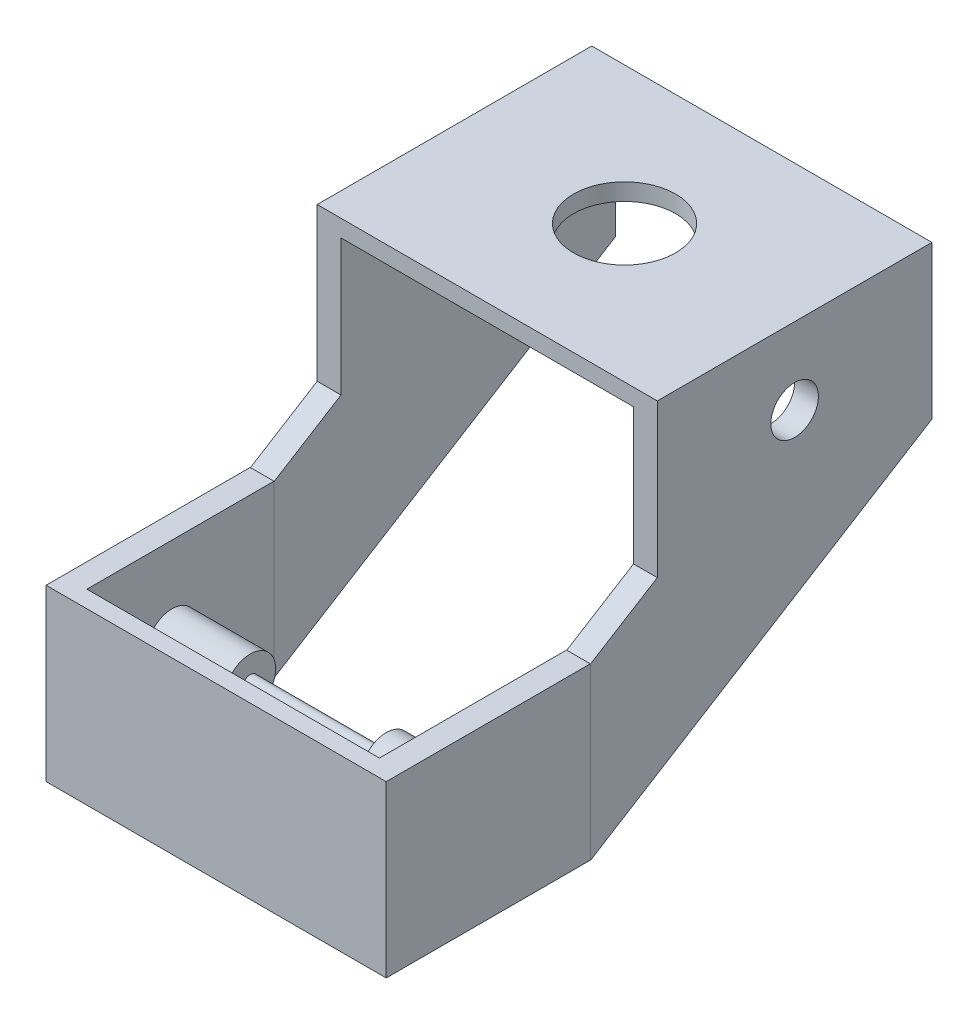
ISO-10303-21;
HEADER;
FILE_DESCRIPTION(('STEP AP214'),'2;1');
FILE_NAME('part.step','',(''),(''),'','','');
FILE_SCHEMA(('AUTOMOTIVE_DESIGN { 1 0 10303 214 1 1 1 1 }'));
ENDSEC;
DATA;
#1=APPLICATION_CONTEXT('core data for automotive mechanical design processes');
#2=APPLICATION_PROTOCOL_DEFINITION('international standard','automotive_design',2000,#1);
#3=PRODUCT_CONTEXT('',#1,'mechanical');
#4=PRODUCT('Part','Part','',(#3));
#5=PRODUCT_RELATED_PRODUCT_CATEGORY('part','',(#4));
#6=PRODUCT_DEFINITION_FORMATION('','',#4);
#7=PRODUCT_DEFINITION_CONTEXT('part definition',#1,'design');
#8=PRODUCT_DEFINITION('design','',#6,#7);
#9=PRODUCT_DEFINITION_SHAPE('','',#8);
#10=(LENGTH_UNIT() NAMED_UNIT(*) SI_UNIT(.MILLI.,.METRE.));
#11=(NAMED_UNIT(*) PLANE_ANGLE_UNIT() SI_UNIT($,.RADIAN.));
#12=(NAMED_UNIT(*) SI_UNIT($,.STERADIAN.) SOLID_ANGLE_UNIT());
#13=UNCERTAINTY_MEASURE_WITH_UNIT(LENGTH_MEASURE(1.E-05),#10,'distance_accuracy_value','');
#14=(GEOMETRIC_REPRESENTATION_CONTEXT(3) GLOBAL_UNCERTAINTY_ASSIGNED_CONTEXT((#13)) GLOBAL_UNIT_ASSIGNED_CONTEXT((#10,
#11,#12)) REPRESENTATION_CONTEXT('',''));
#15=CARTESIAN_POINT('',(0.,0.,0.));
#16=DIRECTION('',(0.,0.,1.));
#17=DIRECTION('',(1.,0.,0.));
#18=AXIS2_PLACEMENT_3D('',#15,#16,#17);
#19=CARTESIAN_POINT('',(0.,0.,-55.));
#20=DIRECTION('',(0.,0.,-1.));
#21=DIRECTION('',(-1.,0.,0.));
#22=AXIS2_PLACEMENT_3D('',#19,#20,#21);
#23=PLANE('',#22);
#24=DIRECTION('',(-1.,0.,0.));
#25=VECTOR('',#24,1.);
#26=CARTESIAN_POINT('',(51.4285714285715,40.5357142857143,-55.));
#27=LINE('',#26,#25);
#28=CARTESIAN_POINT('',(44.5,40.5357142857143,-55.));
#29=VERTEX_POINT('',#28);
#30=CARTESIAN_POINT('',(44.4285714285715,40.5357142857143,-55.));
#31=VERTEX_POINT('',#30);
#32=EDGE_CURVE('E303',#29,#31,#27,.T.);
#33=ORIENTED_EDGE('',*,*,#32,.F.);
#34=DIRECTION('',(0.,-1.,0.));
#35=VECTOR('',#34,1.);
#36=CARTESIAN_POINT('',(44.5,40.5357142857143,-55.));
#37=LINE('',#36,#35);
#38=CARTESIAN_POINT('',(44.5,-9.46428571428572,-55.));
#39=VERTEX_POINT('',#38);
#40=EDGE_CURVE('E254',#29,#39,#37,.T.);
#41=ORIENTED_EDGE('',*,*,#40,.T.);
#42=DIRECTION('',(1.,0.,0.));
#43=VECTOR('',#42,1.);
#44=CARTESIAN_POINT('',(51.4285714285715,-9.46428571428572,-55.));
#45=LINE('',#44,#43);
#46=CARTESIAN_POINT('',(44.4285714285715,-9.46428571428572,-55.));
#47=VERTEX_POINT('',#46);
#48=EDGE_CURVE('E311',#47,#39,#45,.T.);
#49=ORIENTED_EDGE('',*,*,#48,.F.);
#50=DIRECTION('',(0.,-1.,0.));
#51=VECTOR('',#50,1.);
#52=CARTESIAN_POINT('',(44.4285714285715,40.5357142857143,-55.));
#53=LINE('',#52,#51);
#54=EDGE_CURVE('E307',#31,#47,#53,.T.);
#55=ORIENTED_EDGE('',*,*,#54,.F.);
#56=EDGE_LOOP('',(#33,#41,#49,#55));
#57=FACE_BOUND('',#56,.T.);
#58=ADVANCED_FACE('F33',(#57),#23,.T.);
#59=CARTESIAN_POINT('',(-48.5714285714285,40.5357142857143,5.));
#60=DIRECTION('',(1.,0.,0.));
#61=DIRECTION('',(0.,1.,0.));
#62=AXIS2_PLACEMENT_3D('',#59,#60,#61);
#63=PLANE('',#62);
#64=DIRECTION('',(0.,0.,-1.));
#65=VECTOR('',#64,1.);
#66=CARTESIAN_POINT('',(-48.5714285714285,40.5357142857143,5.));
#67=LINE('',#66,#65);
#68=CARTESIAN_POINT('',(-48.5714285714285,40.5357142857143,5.));
#69=VERTEX_POINT('',#68);
#70=CARTESIAN_POINT('',(-48.5714285714285,40.5357142857143,-55.));
#71=VERTEX_POINT('',#70);
#72=EDGE_CURVE('E332',#69,#71,#67,.T.);
#73=ORIENTED_EDGE('',*,*,#72,.T.);
#74=DIRECTION('',(0.,-1.,0.));
#75=VECTOR('',#74,1.);
#76=CARTESIAN_POINT('',(-48.5714285714285,40.5357142857143,-55.));
#77=LINE('',#76,#75);
#78=CARTESIAN_POINT('',(-48.5714285714285,-9.46428571428572,-55.));
#79=VERTEX_POINT('',#78);
#80=EDGE_CURVE('E279',#71,#79,#77,.T.);
#81=ORIENTED_EDGE('',*,*,#80,.T.);
#82=DIRECTION('',(0.,0.,-1.));
#83=VECTOR('',#82,1.);
#84=CARTESIAN_POINT('',(-48.5714285714285,-9.46428571428572,5.));
#85=LINE('',#84,#83);
#86=CARTESIAN_POINT('',(-48.5714285714285,-9.46428571428572,5.));
#87=VERTEX_POINT('',#86);
#88=EDGE_CURVE('E344',#87,#79,#85,.T.);
#89=ORIENTED_EDGE('',*,*,#88,.F.);
#90=DIRECTION('',(0.,-1.,0.));
#91=VECTOR('',#90,1.);
#92=CARTESIAN_POINT('',(-48.5714285714285,40.5357142857143,5.));
#93=LINE('',#92,#91);
#94=EDGE_CURVE('E322',#69,#87,#93,.T.);
#95=ORIENTED_EDGE('',*,*,#94,.F.);
#96=EDGE_LOOP('',(#73,#81,#89,#95));
#97=FACE_BOUND('',#96,.T.);
#98=ADVANCED_FACE('F35',(#97),#63,.F.);
#99=CARTESIAN_POINT('',(-48.5714285714285,-9.46428571428572,5.));
#100=DIRECTION('',(0.,1.,0.));
#101=DIRECTION('',(0.,0.,1.));
#102=AXIS2_PLACEMENT_3D('',#99,#100,#101);
#103=PLANE('',#102);
#104=ORIENTED_EDGE('',*,*,#88,.T.);
#105=DIRECTION('',(1.,0.,0.));
#106=VECTOR('',#105,1.);
#107=CARTESIAN_POINT('',(-48.5714285714285,-9.46428571428572,-55.));
#108=LINE('',#107,#106);
#109=CARTESIAN_POINT('',(-48.4999999999996,-9.46428571428572,-55.));
#110=VERTEX_POINT('',#109);
#111=EDGE_CURVE('E282',#79,#110,#108,.T.);
#112=ORIENTED_EDGE('',*,*,#111,.T.);
#113=DIRECTION('',(1.,0.,0.));
#114=VECTOR('',#113,1.);
#115=CARTESIAN_POINT('',(-48.4999999999996,-9.46428571428572,-55.0000000000007));
#116=LINE('',#115,#114);
#117=CARTESIAN_POINT('',(-41.5714285714285,-9.46428571428572,-55.0000000000006));
#118=VERTEX_POINT('',#117);
#119=EDGE_CURVE('E48',#110,#118,#116,.T.);
#120=ORIENTED_EDGE('',*,*,#119,.T.);
#121=DIRECTION('',(0.,0.,1.));
#122=VECTOR('',#121,1.);
#123=CARTESIAN_POINT('',(-41.5714285714285,-9.46428571428572,-55.));
#124=LINE('',#123,#122);
#125=CARTESIAN_POINT('',(-41.5714285714285,-9.46428571428572,0.));
#126=VERTEX_POINT('',#125);
#127=EDGE_CURVE('E292',#118,#126,#124,.T.);
#128=ORIENTED_EDGE('',*,*,#127,.T.);
#129=DIRECTION('',(1.,0.,0.));
#130=VECTOR('',#129,1.);
#131=CARTESIAN_POINT('',(-48.5714285714285,-9.46428571428572,0.));
#132=LINE('',#131,#130);
#133=CARTESIAN_POINT('',(44.4285714285715,-9.46428571428572,0.));
#134=VERTEX_POINT('',#133);
#135=EDGE_CURVE('E320',#126,#134,#132,.T.);
#136=ORIENTED_EDGE('',*,*,#135,.T.);
#137=DIRECTION('',(0.,0.,1.));
#138=VECTOR('',#137,1.);
#139=CARTESIAN_POINT('',(44.4285714285715,-9.46428571428572,-55.));
#140=LINE('',#139,#138);
#141=EDGE_CURVE('E317',#47,#134,#140,.T.);
#142=ORIENTED_EDGE('',*,*,#141,.F.);
#143=ORIENTED_EDGE('',*,*,#48,.T.);
#144=CARTESIAN_POINT('',(51.4285714285715,-9.46428571428572,-55.));
#145=VERTEX_POINT('',#144);
#146=EDGE_CURVE('E310',#39,#145,#45,.T.);
#147=ORIENTED_EDGE('',*,*,#146,.T.);
#148=DIRECTION('',(0.,0.,-1.));
#149=VECTOR('',#148,1.);
#150=CARTESIAN_POINT('',(51.4285714285715,-9.46428571428572,5.));
#151=LINE('',#150,#149);
#152=CARTESIAN_POINT('',(51.4285714285715,-9.46428571428572,5.));
#153=VERTEX_POINT('',#152);
#154=EDGE_CURVE('E341',#153,#145,#151,.T.);
#155=ORIENTED_EDGE('',*,*,#154,.F.);
#156=DIRECTION('',(1.,0.,0.));
#157=VECTOR('',#156,1.);
#158=CARTESIAN_POINT('',(-48.5714285714285,-9.46428571428572,5.));
#159=LINE('',#158,#157);
#160=EDGE_CURVE('E325',#87,#153,#159,.T.);
#161=ORIENTED_EDGE('',*,*,#160,.F.);
#162=EDGE_LOOP('',(#104,#112,#120,#128,#136,#142,#143,#147,#155,#161));
#163=FACE_BOUND('',#162,.T.);
#164=ADVANCED_FACE('F377',(#163),#103,.F.);
#165=CARTESIAN_POINT('',(51.4285714285715,40.5357142857143,5.));
#166=DIRECTION('',(-1.,0.,0.));
#167=DIRECTION('',(0.,-1.,0.));
#168=AXIS2_PLACEMENT_3D('',#165,#166,#167);
#169=PLANE('',#168);
#170=ORIENTED_EDGE('',*,*,#154,.T.);
#171=DIRECTION('',(0.,1.,0.));
#172=VECTOR('',#171,1.);
#173=CARTESIAN_POINT('',(51.4285714285715,40.5357142857143,-55.));
#174=LINE('',#173,#172);
#175=CARTESIAN_POINT('',(51.4285714285715,40.5357142857143,-55.));
#176=VERTEX_POINT('',#175);
#177=EDGE_CURVE('E300',#145,#176,#174,.T.);
#178=ORIENTED_EDGE('',*,*,#177,.T.);
#179=DIRECTION('',(0.,0.,-1.));
#180=VECTOR('',#179,1.);
#181=CARTESIAN_POINT('',(51.4285714285715,40.5357142857143,5.));
#182=LINE('',#181,#180);
#183=CARTESIAN_POINT('',(51.4285714285715,40.5357142857143,5.));
#184=VERTEX_POINT('',#183);
#185=EDGE_CURVE('E338',#184,#176,#182,.T.);
#186=ORIENTED_EDGE('',*,*,#185,.F.);
#187=DIRECTION('',(0.,1.,0.));
#188=VECTOR('',#187,1.);
#189=CARTESIAN_POINT('',(51.4285714285715,40.5357142857143,5.));
#190=LINE('',#189,#188);
#191=EDGE_CURVE('E328',#153,#184,#190,.T.);
#192=ORIENTED_EDGE('',*,*,#191,.F.);
#193=EDGE_LOOP('',(#170,#178,#186,#192));
#194=FACE_BOUND('',#193,.T.);
#195=ADVANCED_FACE('F399',(#194),#169,.F.);
#196=CARTESIAN_POINT('',(-48.5714285714285,40.5357142857143,5.));
#197=DIRECTION('',(0.,-1.,0.));
#198=DIRECTION('',(0.,0.,-1.));
#199=AXIS2_PLACEMENT_3D('',#196,#197,#198);
#200=PLANE('',#199);
#201=ORIENTED_EDGE('',*,*,#185,.T.);
#202=EDGE_CURVE('E304',#176,#29,#27,.T.);
#203=ORIENTED_EDGE('',*,*,#202,.T.);
#204=ORIENTED_EDGE('',*,*,#32,.T.);
#205=DIRECTION('',(0.,0.,1.));
#206=VECTOR('',#205,1.);
#207=CARTESIAN_POINT('',(44.4285714285715,40.5357142857143,-55.));
#208=LINE('',#207,#206);
#209=CARTESIAN_POINT('',(44.4285714285715,40.5357142857143,0.));
#210=VERTEX_POINT('',#209);
#211=EDGE_CURVE('E314',#31,#210,#208,.T.);
#212=ORIENTED_EDGE('',*,*,#211,.T.);
#213=DIRECTION('',(-1.,0.,0.));
#214=VECTOR('',#213,1.);
#215=CARTESIAN_POINT('',(-48.5714285714285,40.5357142857143,0.));
#216=LINE('',#215,#214);
#217=CARTESIAN_POINT('',(-41.5714285714285,40.5357142857143,0.));
#218=VERTEX_POINT('',#217);
#219=EDGE_CURVE('E326',#210,#218,#216,.T.);
#220=ORIENTED_EDGE('',*,*,#219,.T.);
#221=DIRECTION('',(0.,0.,1.));
#222=VECTOR('',#221,1.);
#223=CARTESIAN_POINT('',(-41.5714285714285,40.5357142857143,-55.));
#224=LINE('',#223,#222);
#225=CARTESIAN_POINT('',(-41.5714285714285,40.5357142857143,-55.0000000000006));
#226=VERTEX_POINT('',#225);
#227=EDGE_CURVE('E295',#226,#218,#224,.T.);
#228=ORIENTED_EDGE('',*,*,#227,.F.);
#229=DIRECTION('',(-1.,0.,0.));
#230=VECTOR('',#229,1.);
#231=CARTESIAN_POINT('',(-48.5714285714285,40.5357142857143,-55.));
#232=LINE('',#231,#230);
#233=CARTESIAN_POINT('',(-48.4999999999996,40.5357142857143,-55.0000000000007));
#234=VERTEX_POINT('',#233);
#235=EDGE_CURVE('E289',#226,#234,#232,.T.);
#236=ORIENTED_EDGE('',*,*,#235,.T.);
#237=EDGE_CURVE('E288',#234,#71,#232,.T.);
#238=ORIENTED_EDGE('',*,*,#237,.T.);
#239=ORIENTED_EDGE('',*,*,#72,.F.);
#240=DIRECTION('',(-1.,0.,0.));
#241=VECTOR('',#240,1.);
#242=CARTESIAN_POINT('',(-48.5714285714285,40.5357142857143,5.));
#243=LINE('',#242,#241);
#244=EDGE_CURVE('E330',#184,#69,#243,.T.);
#245=ORIENTED_EDGE('',*,*,#244,.F.);
#246=EDGE_LOOP('',(#201,#203,#204,#212,#220,#228,#236,#238,#239,#245));
#247=FACE_BOUND('',#246,.T.);
#248=ADVANCED_FACE('F392',(#247),#200,.F.);
#249=CARTESIAN_POINT('',(0.,0.,5.));
#250=DIRECTION('',(0.,0.,1.));
#251=DIRECTION('',(1.,0.,0.));
#252=AXIS2_PLACEMENT_3D('',#249,#250,#251);
#253=PLANE('',#252);
#254=ORIENTED_EDGE('',*,*,#94,.T.);
#255=ORIENTED_EDGE('',*,*,#160,.T.);
#256=ORIENTED_EDGE('',*,*,#191,.T.);
#257=ORIENTED_EDGE('',*,*,#244,.T.);
#258=EDGE_LOOP('',(#254,#255,#256,#257));
#259=FACE_BOUND('',#258,.T.);
#260=ADVANCED_FACE('F389',(#259),#253,.T.);
#261=CARTESIAN_POINT('',(0.,0.,0.));
#262=DIRECTION('',(0.,0.,1.));
#263=DIRECTION('',(1.,0.,0.));
#264=AXIS2_PLACEMENT_3D('',#261,#262,#263);
#265=PLANE('',#264);
#266=ORIENTED_EDGE('',*,*,#135,.F.);
#267=DIRECTION('',(0.,1.,0.));
#268=VECTOR('',#267,1.);
#269=CARTESIAN_POINT('',(-41.5714285714285,40.5357142857143,0.));
#270=LINE('',#269,#268);
#271=EDGE_CURVE('E278',#126,#218,#270,.T.);
#272=ORIENTED_EDGE('',*,*,#271,.T.);
#273=ORIENTED_EDGE('',*,*,#219,.F.);
#274=DIRECTION('',(0.,-1.,0.));
#275=VECTOR('',#274,1.);
#276=CARTESIAN_POINT('',(44.4285714285715,40.5357142857143,0.));
#277=LINE('',#276,#275);
#278=EDGE_CURVE('E297',#210,#134,#277,.T.);
#279=ORIENTED_EDGE('',*,*,#278,.T.);
#280=EDGE_LOOP('',(#266,#272,#273,#279));
#281=FACE_BOUND('',#280,.T.);
#282=ADVANCED_FACE('F387',(#281),#265,.F.);
#283=CARTESIAN_POINT('',(44.4285714285715,40.5357142857143,-55.));
#284=DIRECTION('',(-1.,0.,0.));
#285=DIRECTION('',(0.,-1.,0.));
#286=AXIS2_PLACEMENT_3D('',#283,#284,#285);
#287=PLANE('',#286);
#288=CARTESIAN_POINT('',(44.4285714285715,15.5357142857143,-25.));
#289=DIRECTION('',(-1.,0.,0.));
#290=DIRECTION('',(0.,-1.,0.));
#291=AXIS2_PLACEMENT_3D('',#288,#289,#290);
#292=CIRCLE('',#291,7.5);
#293=CARTESIAN_POINT('',(44.4285714285715,8.0357142857143,-25.));
#294=VERTEX_POINT('',#293);
#295=EDGE_CURVE('E526',#294,#294,#292,.T.);
#296=ORIENTED_EDGE('',*,*,#295,.F.);
#297=EDGE_LOOP('',(#296));
#298=FACE_BOUND('',#297,.T.);
#299=ORIENTED_EDGE('',*,*,#278,.F.);
#300=ORIENTED_EDGE('',*,*,#211,.F.);
#301=ORIENTED_EDGE('',*,*,#54,.T.);
#302=ORIENTED_EDGE('',*,*,#141,.T.);
#303=EDGE_LOOP('',(#299,#300,#301,#302));
#304=FACE_BOUND('',#303,.T.);
#305=ADVANCED_FACE('F384',(#298,#304),#287,.T.);
#306=CARTESIAN_POINT('',(-41.5714285714285,40.5357142857143,-55.));
#307=DIRECTION('',(1.,0.,0.));
#308=DIRECTION('',(0.,1.,0.));
#309=AXIS2_PLACEMENT_3D('',#306,#307,#308);
#310=PLANE('',#309);
#311=CARTESIAN_POINT('',(-41.5714285714285,15.5357142857143,-25.));
#312=DIRECTION('',(1.,0.,0.));
#313=DIRECTION('',(0.,1.,0.));
#314=AXIS2_PLACEMENT_3D('',#311,#312,#313);
#315=CIRCLE('',#314,7.5);
#316=CARTESIAN_POINT('',(-41.5714285714285,23.0357142857143,-25.));
#317=VERTEX_POINT('',#316);
#318=EDGE_CURVE('E532',#317,#317,#315,.T.);
#319=ORIENTED_EDGE('',*,*,#318,.F.);
#320=EDGE_LOOP('',(#319));
#321=FACE_BOUND('',#320,.T.);
#322=ORIENTED_EDGE('',*,*,#271,.F.);
#323=ORIENTED_EDGE('',*,*,#127,.F.);
#324=DIRECTION('',(0.,1.,0.));
#325=VECTOR('',#324,1.);
#326=CARTESIAN_POINT('',(-41.5714285714285,40.5357142857143,-55.));
#327=LINE('',#326,#325);
#328=EDGE_CURVE('E285',#118,#226,#327,.T.);
#329=ORIENTED_EDGE('',*,*,#328,.T.);
#330=ORIENTED_EDGE('',*,*,#227,.T.);
#331=EDGE_LOOP('',(#322,#323,#329,#330));
#332=FACE_BOUND('',#331,.T.);
#333=ADVANCED_FACE('F382',(#321,#332),#310,.T.);
#334=CARTESIAN_POINT('',(0.,0.,-55.));
#335=DIRECTION('',(0.,0.,1.));
#336=DIRECTION('',(1.,0.,0.));
#337=AXIS2_PLACEMENT_3D('',#334,#335,#336);
#338=PLANE('',#337);
#339=ORIENTED_EDGE('',*,*,#237,.F.);
#340=DIRECTION('',(0.,1.,0.));
#341=VECTOR('',#340,1.);
#342=CARTESIAN_POINT('',(-48.4999999999996,-9.46428571428572,-55.0000000000007));
#343=LINE('',#342,#341);
#344=EDGE_CURVE('E236',#110,#234,#343,.T.);
#345=ORIENTED_EDGE('',*,*,#344,.F.);
#346=ORIENTED_EDGE('',*,*,#111,.F.);
#347=ORIENTED_EDGE('',*,*,#80,.F.);
#348=EDGE_LOOP('',(#339,#345,#346,#347));
#349=FACE_BOUND('',#348,.T.);
#350=ADVANCED_FACE('F415',(#349),#338,.F.);
#351=CARTESIAN_POINT('',(51.5,40.5357142857143,-55.));
#352=DIRECTION('',(0.,0.,-1.));
#353=DIRECTION('',(-1.,0.,0.));
#354=AXIS2_PLACEMENT_3D('',#351,#352,#353);
#355=PLANE('',#354);
#356=DIRECTION('',(-1.,0.,0.));
#357=VECTOR('',#356,1.);
#358=CARTESIAN_POINT('',(51.5,40.5357142857143,-55.));
#359=LINE('',#358,#357);
#360=CARTESIAN_POINT('',(51.5,40.5357142857143,-55.));
#361=VERTEX_POINT('',#360);
#362=EDGE_CURVE('E263',#361,#176,#359,.T.);
#363=ORIENTED_EDGE('',*,*,#362,.T.);
#364=ORIENTED_EDGE('',*,*,#177,.F.);
#365=DIRECTION('',(-1.,0.,0.));
#366=VECTOR('',#365,1.);
#367=CARTESIAN_POINT('',(51.5,-9.46428571428572,-55.));
#368=LINE('',#367,#366);
#369=CARTESIAN_POINT('',(51.5,-9.46428571428572,-55.));
#370=VERTEX_POINT('',#369);
#371=EDGE_CURVE('E275',#370,#145,#368,.T.);
#372=ORIENTED_EDGE('',*,*,#371,.F.);
#373=DIRECTION('',(0.,-1.,0.));
#374=VECTOR('',#373,1.);
#375=CARTESIAN_POINT('',(51.5,40.5357142857143,-55.));
#376=LINE('',#375,#374);
#377=EDGE_CURVE('E255',#361,#370,#376,.T.);
#378=ORIENTED_EDGE('',*,*,#377,.F.);
#379=EDGE_LOOP('',(#363,#364,#372,#378));
#380=FACE_BOUND('',#379,.T.);
#381=ADVANCED_FACE('F461',(#380),#355,.F.);
#382=CARTESIAN_POINT('',(51.5,-9.46428571428572,-55.));
#383=DIRECTION('',(0.,0.85013958156878,0.526557396539124));
#384=DIRECTION('',(0.,-0.526557396539124,0.85013958156878));
#385=AXIS2_PLACEMENT_3D('',#382,#383,#384);
#386=PLANE('',#385);
#387=DIRECTION('',(0.,0.526557396539124,-0.850139581568779));
#388=VECTOR('',#387,1.);
#389=CARTESIAN_POINT('',(44.5,-9.46428571428572,-55.));
#390=LINE('',#389,#388);
#391=CARTESIAN_POINT('',(44.5,52.6962567288137,-155.359690871303));
#392=VERTEX_POINT('',#391);
#393=EDGE_CURVE('E56',#39,#392,#390,.T.);
#394=ORIENTED_EDGE('',*,*,#393,.T.);
#395=DIRECTION('',(-1.,0.,0.));
#396=VECTOR('',#395,1.);
#397=CARTESIAN_POINT('',(51.5,52.6962567288137,-155.359690871303));
#398=LINE('',#397,#396);
#399=CARTESIAN_POINT('',(51.5,52.6962567288137,-155.359690871303));
#400=VERTEX_POINT('',#399);
#401=EDGE_CURVE('E272',#400,#392,#398,.T.);
#402=ORIENTED_EDGE('',*,*,#401,.F.);
#403=DIRECTION('',(0.,0.526557396539124,-0.850139581568779));
#404=VECTOR('',#403,1.);
#405=CARTESIAN_POINT('',(51.5,-9.46428571428572,-55.));
#406=LINE('',#405,#404);
#407=EDGE_CURVE('E258',#370,#400,#406,.T.);
#408=ORIENTED_EDGE('',*,*,#407,.F.);
#409=ORIENTED_EDGE('',*,*,#371,.T.);
#410=ORIENTED_EDGE('',*,*,#146,.F.);
#411=EDGE_LOOP('',(#394,#402,#408,#409,#410));
#412=FACE_BOUND('',#411,.T.);
#413=ADVANCED_FACE('F449',(#412),#386,.F.);
#414=CARTESIAN_POINT('',(51.5,40.5357142857143,-55.));
#415=DIRECTION('',(0.,-0.850139581568782,-0.526557396539121));
#416=DIRECTION('',(0.,0.526557396539121,-0.850139581568782));
#417=AXIS2_PLACEMENT_3D('',#414,#415,#416);
#418=PLANE('',#417);
#419=DIRECTION('',(0.,-0.526557396539121,0.850139581568782));
#420=VECTOR('',#419,1.);
#421=CARTESIAN_POINT('',(44.5,40.5357142857143,-55.));
#422=LINE('',#421,#420);
#423=CARTESIAN_POINT('',(44.5,52.6962567288137,-74.633488262011));
#424=VERTEX_POINT('',#423);
#425=EDGE_CURVE('E259',#424,#29,#422,.T.);
#426=ORIENTED_EDGE('',*,*,#425,.T.);
#427=ORIENTED_EDGE('',*,*,#202,.F.);
#428=ORIENTED_EDGE('',*,*,#362,.F.);
#429=DIRECTION('',(0.,-0.526557396539121,0.850139581568782));
#430=VECTOR('',#429,1.);
#431=CARTESIAN_POINT('',(51.5,40.5357142857143,-55.));
#432=LINE('',#431,#430);
#433=CARTESIAN_POINT('',(51.5,52.6962567288137,-74.633488262011));
#434=VERTEX_POINT('',#433);
#435=EDGE_CURVE('E261',#434,#361,#432,.T.);
#436=ORIENTED_EDGE('',*,*,#435,.F.);
#437=DIRECTION('',(-1.,0.,0.));
#438=VECTOR('',#437,1.);
#439=CARTESIAN_POINT('',(51.5,52.6962567288137,-74.633488262011));
#440=LINE('',#439,#438);
#441=EDGE_CURVE('E270',#434,#424,#440,.T.);
#442=ORIENTED_EDGE('',*,*,#441,.T.);
#443=EDGE_LOOP('',(#426,#427,#428,#436,#442));
#444=FACE_BOUND('',#443,.T.);
#445=ADVANCED_FACE('F436',(#444),#418,.F.);
#446=CARTESIAN_POINT('',(51.5,0.,0.));
#447=DIRECTION('',(1.,0.,0.));
#448=DIRECTION('',(0.,0.,-1.));
#449=AXIS2_PLACEMENT_3D('',#446,#447,#448);
#450=PLANE('',#449);
#451=CARTESIAN_POINT('',(51.5000000000008,75.1962567288137,-114.996589566657));
#452=DIRECTION('',(-1.,0.,0.));
#453=DIRECTION('',(0.,0.,1.));
#454=AXIS2_PLACEMENT_3D('',#451,#452,#453);
#455=CIRCLE('',#454,7.);
#456=CARTESIAN_POINT('',(51.5000000000008,75.1962567288137,-107.996589566657));
#457=VERTEX_POINT('',#456);
#458=EDGE_CURVE('E348',#457,#457,#455,.T.);
#459=ORIENTED_EDGE('',*,*,#458,.T.);
#460=EDGE_LOOP('',(#459));
#461=FACE_BOUND('',#460,.T.);
#462=ORIENTED_EDGE('',*,*,#377,.T.);
#463=ORIENTED_EDGE('',*,*,#407,.T.);
#464=DIRECTION('',(0.,1.,0.));
#465=VECTOR('',#464,1.);
#466=CARTESIAN_POINT('',(51.5,92.6962567288137,-155.359690871304));
#467=LINE('',#466,#465);
#468=CARTESIAN_POINT('',(51.5,97.6962567288137,-155.359690871304));
#469=VERTEX_POINT('',#468);
#470=EDGE_CURVE('E215',#400,#469,#467,.T.);
#471=ORIENTED_EDGE('',*,*,#470,.T.);
#472=DIRECTION('',(0.,0.,-1.));
#473=VECTOR('',#472,1.);
#474=CARTESIAN_POINT('',(51.5,97.6962567288137,-155.359690871304));
#475=LINE('',#474,#473);
#476=CARTESIAN_POINT('',(51.5,97.6962567288137,-74.6334882620116));
#477=VERTEX_POINT('',#476);
#478=EDGE_CURVE('E195',#477,#469,#475,.T.);
#479=ORIENTED_EDGE('',*,*,#478,.F.);
#480=DIRECTION('',(0.,-1.,0.));
#481=VECTOR('',#480,1.);
#482=CARTESIAN_POINT('',(51.5,52.6962567288137,-74.633488262011));
#483=LINE('',#482,#481);
#484=EDGE_CURVE('E191',#477,#434,#483,.T.);
#485=ORIENTED_EDGE('',*,*,#484,.T.);
#486=ORIENTED_EDGE('',*,*,#435,.T.);
#487=EDGE_LOOP('',(#462,#463,#471,#479,#485,#486));
#488=FACE_BOUND('',#487,.T.);
#489=ADVANCED_FACE('F440',(#461,#488),#450,.T.);
#490=CARTESIAN_POINT('',(44.5,0.,0.));
#491=DIRECTION('',(1.,0.,0.));
#492=DIRECTION('',(0.,0.,-1.));
#493=AXIS2_PLACEMENT_3D('',#490,#491,#492);
#494=PLANE('',#493);
#495=CARTESIAN_POINT('',(44.5,75.1962567288137,-114.996589566657));
#496=DIRECTION('',(1.,0.,0.));
#497=DIRECTION('',(0.,0.,-1.));
#498=AXIS2_PLACEMENT_3D('',#495,#496,#497);
#499=CIRCLE('',#498,7.);
#500=CARTESIAN_POINT('',(44.5,75.1962567288137,-121.996589566657));
#501=VERTEX_POINT('',#500);
#502=EDGE_CURVE('E207',#501,#501,#499,.T.);
#503=ORIENTED_EDGE('',*,*,#502,.T.);
#504=EDGE_LOOP('',(#503));
#505=FACE_BOUND('',#504,.T.);
#506=ORIENTED_EDGE('',*,*,#40,.F.);
#507=ORIENTED_EDGE('',*,*,#425,.F.);
#508=DIRECTION('',(0.,-1.,0.));
#509=VECTOR('',#508,1.);
#510=CARTESIAN_POINT('',(44.5,52.6962567288137,-74.633488262011));
#511=LINE('',#510,#509);
#512=CARTESIAN_POINT('',(44.5,92.6962567288137,-74.6334882620116));
#513=VERTEX_POINT('',#512);
#514=EDGE_CURVE('E217',#513,#424,#511,.T.);
#515=ORIENTED_EDGE('',*,*,#514,.F.);
#516=DIRECTION('',(0.,0.,1.));
#517=VECTOR('',#516,1.);
#518=CARTESIAN_POINT('',(44.5,92.6962567288137,-74.6334882620116));
#519=LINE('',#518,#517);
#520=CARTESIAN_POINT('',(44.5,92.6962567288137,-155.359690871304));
#521=VERTEX_POINT('',#520);
#522=EDGE_CURVE('E221',#521,#513,#519,.T.);
#523=ORIENTED_EDGE('',*,*,#522,.F.);
#524=DIRECTION('',(0.,1.,0.));
#525=VECTOR('',#524,1.);
#526=CARTESIAN_POINT('',(44.5,92.6962567288137,-155.359690871304));
#527=LINE('',#526,#525);
#528=EDGE_CURVE('E212',#392,#521,#527,.T.);
#529=ORIENTED_EDGE('',*,*,#528,.F.);
#530=ORIENTED_EDGE('',*,*,#393,.F.);
#531=EDGE_LOOP('',(#506,#507,#515,#523,#529,#530));
#532=FACE_BOUND('',#531,.T.);
#533=ADVANCED_FACE('F433',(#505,#532),#494,.F.);
#534=CARTESIAN_POINT('',(-48.4999999999989,52.6962567288137,-155.359690871304));
#535=DIRECTION('',(0.,0.850139581568779,0.526557396539124));
#536=DIRECTION('',(0.,-0.526557396539124,0.850139581568779));
#537=AXIS2_PLACEMENT_3D('',#534,#535,#536);
#538=PLANE('',#537);
#539=DIRECTION('',(0.,-0.526557396539124,0.850139581568779));
#540=VECTOR('',#539,1.);
#541=CARTESIAN_POINT('',(-41.4999999999989,52.6962567288137,-155.359690871304));
#542=LINE('',#541,#540);
#543=CARTESIAN_POINT('',(-41.4999999999989,52.6962567288137,-155.359690871304));
#544=VERTEX_POINT('',#543);
#545=CARTESIAN_POINT('',(-41.4999999999996,-9.46428571428572,-55.0000000000006));
#546=VERTEX_POINT('',#545);
#547=EDGE_CURVE('E227',#544,#546,#542,.T.);
#548=ORIENTED_EDGE('',*,*,#547,.T.);
#549=EDGE_CURVE('E252',#118,#546,#116,.T.);
#550=ORIENTED_EDGE('',*,*,#549,.F.);
#551=ORIENTED_EDGE('',*,*,#119,.F.);
#552=DIRECTION('',(0.,-0.526557396539124,0.850139581568779));
#553=VECTOR('',#552,1.);
#554=CARTESIAN_POINT('',(-48.4999999999989,52.6962567288137,-155.359690871304));
#555=LINE('',#554,#553);
#556=CARTESIAN_POINT('',(-48.4999999999989,52.6962567288137,-155.359690871304));
#557=VERTEX_POINT('',#556);
#558=EDGE_CURVE('E234',#557,#110,#555,.T.);
#559=ORIENTED_EDGE('',*,*,#558,.F.);
#560=DIRECTION('',(1.,0.,0.));
#561=VECTOR('',#560,1.);
#562=CARTESIAN_POINT('',(-48.4999999999989,52.6962567288137,-155.359690871304));
#563=LINE('',#562,#561);
#564=EDGE_CURVE('E240',#557,#544,#563,.T.);
#565=ORIENTED_EDGE('',*,*,#564,.T.);
#566=EDGE_LOOP('',(#548,#550,#551,#559,#565));
#567=FACE_BOUND('',#566,.T.);
#568=ADVANCED_FACE('F445',(#567),#538,.F.);
#569=CARTESIAN_POINT('',(-48.4999999999996,-9.46428571428572,-55.0000000000007));
#570=DIRECTION('',(0.,0.,-1.));
#571=DIRECTION('',(-1.,0.,0.));
#572=AXIS2_PLACEMENT_3D('',#569,#570,#571);
#573=PLANE('',#572);
#574=ORIENTED_EDGE('',*,*,#328,.F.);
#575=ORIENTED_EDGE('',*,*,#549,.T.);
#576=DIRECTION('',(0.,1.,0.));
#577=VECTOR('',#576,1.);
#578=CARTESIAN_POINT('',(-41.4999999999996,-9.46428571428572,-55.0000000000006));
#579=LINE('',#578,#577);
#580=CARTESIAN_POINT('',(-41.4999999999996,40.5357142857143,-55.0000000000006));
#581=VERTEX_POINT('',#580);
#582=EDGE_CURVE('E243',#546,#581,#579,.T.);
#583=ORIENTED_EDGE('',*,*,#582,.T.);
#584=DIRECTION('',(1.,0.,0.));
#585=VECTOR('',#584,1.);
#586=CARTESIAN_POINT('',(-48.4999999999996,40.5357142857143,-55.0000000000007));
#587=LINE('',#586,#585);
#588=EDGE_CURVE('E250',#226,#581,#587,.T.);
#589=ORIENTED_EDGE('',*,*,#588,.F.);
#590=EDGE_LOOP('',(#574,#575,#583,#589));
#591=FACE_BOUND('',#590,.T.);
#592=ADVANCED_FACE('F481',(#591),#573,.F.);
#593=CARTESIAN_POINT('',(-48.4999999999996,40.5357142857143,-55.0000000000007));
#594=DIRECTION('',(0.,-0.850139581568782,-0.526557396539121));
#595=DIRECTION('',(0.,0.526557396539121,-0.850139581568782));
#596=AXIS2_PLACEMENT_3D('',#593,#594,#595);
#597=PLANE('',#596);
#598=DIRECTION('',(0.,0.526557396539121,-0.850139581568782));
#599=VECTOR('',#598,1.);
#600=CARTESIAN_POINT('',(-41.4999999999996,40.5357142857143,-55.0000000000006));
#601=LINE('',#600,#599);
#602=CARTESIAN_POINT('',(-41.4999999999995,52.6962567288137,-74.6334882620116));
#603=VERTEX_POINT('',#602);
#604=EDGE_CURVE('E237',#581,#603,#601,.T.);
#605=ORIENTED_EDGE('',*,*,#604,.T.);
#606=DIRECTION('',(1.,0.,0.));
#607=VECTOR('',#606,1.);
#608=CARTESIAN_POINT('',(-48.4999999999995,52.6962567288137,-74.6334882620117));
#609=LINE('',#608,#607);
#610=CARTESIAN_POINT('',(-48.4999999999995,52.6962567288137,-74.6334882620117));
#611=VERTEX_POINT('',#610);
#612=EDGE_CURVE('E248',#611,#603,#609,.T.);
#613=ORIENTED_EDGE('',*,*,#612,.F.);
#614=DIRECTION('',(0.,0.526557396539121,-0.850139581568782));
#615=VECTOR('',#614,1.);
#616=CARTESIAN_POINT('',(-48.4999999999996,40.5357142857143,-55.0000000000007));
#617=LINE('',#616,#615);
#618=EDGE_CURVE('E179',#234,#611,#617,.T.);
#619=ORIENTED_EDGE('',*,*,#618,.F.);
#620=ORIENTED_EDGE('',*,*,#235,.F.);
#621=ORIENTED_EDGE('',*,*,#588,.T.);
#622=EDGE_LOOP('',(#605,#613,#619,#620,#621));
#623=FACE_BOUND('',#622,.T.);
#624=ADVANCED_FACE('F421',(#623),#597,.F.);
#625=CARTESIAN_POINT('',(-48.5,0.,-3.38682087728862E-13));
#626=DIRECTION('',(-1.,0.,0.));
#627=DIRECTION('',(0.,0.,1.));
#628=AXIS2_PLACEMENT_3D('',#625,#626,#627);
#629=PLANE('',#628);
#630=CARTESIAN_POINT('',(-48.4999999999992,75.1962567288137,-114.996589566658));
#631=DIRECTION('',(-1.,0.,0.));
#632=DIRECTION('',(0.,0.,1.));
#633=AXIS2_PLACEMENT_3D('',#630,#631,#632);
#634=CIRCLE('',#633,7.);
#635=CARTESIAN_POINT('',(-48.4999999999992,75.1962567288137,-107.996589566658));
#636=VERTEX_POINT('',#635);
#637=EDGE_CURVE('E515',#636,#636,#634,.T.);
#638=ORIENTED_EDGE('',*,*,#637,.F.);
#639=EDGE_LOOP('',(#638));
#640=FACE_BOUND('',#639,.T.);
#641=ORIENTED_EDGE('',*,*,#558,.T.);
#642=ORIENTED_EDGE('',*,*,#344,.T.);
#643=ORIENTED_EDGE('',*,*,#618,.T.);
#644=DIRECTION('',(0.,1.,0.));
#645=VECTOR('',#644,1.);
#646=CARTESIAN_POINT('',(-48.4999999999995,52.6962567288137,-74.6334882620117));
#647=LINE('',#646,#645);
#648=CARTESIAN_POINT('',(-48.4999999999989,97.6962567288137,-74.6334882620116));
#649=VERTEX_POINT('',#648);
#650=EDGE_CURVE('E172',#611,#649,#647,.T.);
#651=ORIENTED_EDGE('',*,*,#650,.T.);
#652=DIRECTION('',(0.,0.,1.));
#653=VECTOR('',#652,1.);
#654=CARTESIAN_POINT('',(-48.4999999999989,97.6962567288137,-155.359690871304));
#655=LINE('',#654,#653);
#656=CARTESIAN_POINT('',(-48.4999999999989,97.6962567288137,-155.359690871304));
#657=VERTEX_POINT('',#656);
#658=EDGE_CURVE('E177',#657,#649,#655,.T.);
#659=ORIENTED_EDGE('',*,*,#658,.F.);
#660=DIRECTION('',(0.,-1.,0.));
#661=VECTOR('',#660,1.);
#662=CARTESIAN_POINT('',(-48.4999999999989,92.6962567288137,-155.359690871304));
#663=LINE('',#662,#661);
#664=EDGE_CURVE('E183',#657,#557,#663,.T.);
#665=ORIENTED_EDGE('',*,*,#664,.T.);
#666=EDGE_LOOP('',(#641,#642,#643,#651,#659,#665));
#667=FACE_BOUND('',#666,.T.);
#668=ADVANCED_FACE('F174',(#640,#667),#629,.T.);
#669=CARTESIAN_POINT('',(-41.5,0.,-2.89801348985058E-13));
#670=DIRECTION('',(-1.,0.,0.));
#671=DIRECTION('',(0.,0.,1.));
#672=AXIS2_PLACEMENT_3D('',#669,#670,#671);
#673=PLANE('',#672);
#674=CARTESIAN_POINT('',(-41.4999999999992,75.1962567288137,-114.996589566658));
#675=DIRECTION('',(-1.,0.,0.));
#676=DIRECTION('',(0.,0.,1.));
#677=AXIS2_PLACEMENT_3D('',#674,#675,#676);
#678=CIRCLE('',#677,7.);
#679=CARTESIAN_POINT('',(-41.4999999999992,75.1962567288137,-107.996589566658));
#680=VERTEX_POINT('',#679);
#681=EDGE_CURVE('E346',#680,#680,#678,.T.);
#682=ORIENTED_EDGE('',*,*,#681,.T.);
#683=EDGE_LOOP('',(#682));
#684=FACE_BOUND('',#683,.T.);
#685=ORIENTED_EDGE('',*,*,#547,.F.);
#686=DIRECTION('',(0.,-1.,0.));
#687=VECTOR('',#686,1.);
#688=CARTESIAN_POINT('',(-41.4999999999989,92.6962567288137,-155.359690871304));
#689=LINE('',#688,#687);
#690=CARTESIAN_POINT('',(-41.4999999999992,92.6962567288137,-155.359690871304));
#691=VERTEX_POINT('',#690);
#692=EDGE_CURVE('E184',#691,#544,#689,.T.);
#693=ORIENTED_EDGE('',*,*,#692,.F.);
#694=DIRECTION('',(0.,0.,-1.));
#695=VECTOR('',#694,1.);
#696=CARTESIAN_POINT('',(-41.4999999999995,92.6962567288137,-74.6334882620116));
#697=LINE('',#696,#695);
#698=CARTESIAN_POINT('',(-41.4999999999995,92.6962567288137,-74.6334882620116));
#699=VERTEX_POINT('',#698);
#700=EDGE_CURVE('E229',#699,#691,#697,.T.);
#701=ORIENTED_EDGE('',*,*,#700,.F.);
#702=DIRECTION('',(0.,1.,0.));
#703=VECTOR('',#702,1.);
#704=CARTESIAN_POINT('',(-41.4999999999995,52.6962567288137,-74.6334882620116));
#705=LINE('',#704,#703);
#706=EDGE_CURVE('E219',#603,#699,#705,.T.);
#707=ORIENTED_EDGE('',*,*,#706,.F.);
#708=ORIENTED_EDGE('',*,*,#604,.F.);
#709=ORIENTED_EDGE('',*,*,#582,.F.);
#710=EDGE_LOOP('',(#685,#693,#701,#707,#708,#709));
#711=FACE_BOUND('',#710,.T.);
#712=ADVANCED_FACE('F428',(#684,#711),#673,.F.);
#713=CARTESIAN_POINT('',(-48.4999999999995,52.6962567288137,-74.6334882620117));
#714=DIRECTION('',(0.,0.,-1.));
#715=DIRECTION('',(-1.,0.,0.));
#716=AXIS2_PLACEMENT_3D('',#713,#714,#715);
#717=PLANE('',#716);
#718=ORIENTED_EDGE('',*,*,#706,.T.);
#719=DIRECTION('',(1.,0.,0.));
#720=VECTOR('',#719,1.);
#721=CARTESIAN_POINT('',(-48.4999999999989,92.6962567288137,-74.6334882620116));
#722=LINE('',#721,#720);
#723=EDGE_CURVE('E204',#699,#513,#722,.T.);
#724=ORIENTED_EDGE('',*,*,#723,.T.);
#725=ORIENTED_EDGE('',*,*,#514,.T.);
#726=ORIENTED_EDGE('',*,*,#441,.F.);
#727=ORIENTED_EDGE('',*,*,#484,.F.);
#728=DIRECTION('',(1.,0.,0.));
#729=VECTOR('',#728,1.);
#730=CARTESIAN_POINT('',(-48.4999999999989,97.6962567288137,-74.6334882620116));
#731=LINE('',#730,#729);
#732=EDGE_CURVE('E187',#649,#477,#731,.T.);
#733=ORIENTED_EDGE('',*,*,#732,.F.);
#734=ORIENTED_EDGE('',*,*,#650,.F.);
#735=ORIENTED_EDGE('',*,*,#612,.T.);
#736=EDGE_LOOP('',(#718,#724,#725,#726,#727,#733,#734,#735));
#737=FACE_BOUND('',#736,.T.);
#738=ADVANCED_FACE('F188',(#737),#717,.F.);
#739=CARTESIAN_POINT('',(-48.4999999999989,92.6962567288137,-155.359690871304));
#740=DIRECTION('',(0.,0.,1.));
#741=DIRECTION('',(1.,0.,0.));
#742=AXIS2_PLACEMENT_3D('',#739,#740,#741);
#743=PLANE('',#742);
#744=ORIENTED_EDGE('',*,*,#692,.T.);
#745=ORIENTED_EDGE('',*,*,#564,.F.);
#746=ORIENTED_EDGE('',*,*,#664,.F.);
#747=DIRECTION('',(-1.,0.,0.));
#748=VECTOR('',#747,1.);
#749=CARTESIAN_POINT('',(-48.4999999999989,97.6962567288137,-155.359690871304));
#750=LINE('',#749,#748);
#751=EDGE_CURVE('E200',#469,#657,#750,.T.);
#752=ORIENTED_EDGE('',*,*,#751,.F.);
#753=ORIENTED_EDGE('',*,*,#470,.F.);
#754=ORIENTED_EDGE('',*,*,#401,.T.);
#755=ORIENTED_EDGE('',*,*,#528,.T.);
#756=DIRECTION('',(-1.,0.,0.));
#757=VECTOR('',#756,1.);
#758=CARTESIAN_POINT('',(-48.4999999999989,92.6962567288137,-155.359690871304));
#759=LINE('',#758,#757);
#760=EDGE_CURVE('E201',#521,#691,#759,.T.);
#761=ORIENTED_EDGE('',*,*,#760,.T.);
#762=EDGE_LOOP('',(#744,#745,#746,#752,#753,#754,#755,#761));
#763=FACE_BOUND('',#762,.T.);
#764=ADVANCED_FACE('F443',(#763),#743,.F.);
#765=CARTESIAN_POINT('',(0.,92.6962567288137,0.));
#766=DIRECTION('',(0.,1.,0.));
#767=DIRECTION('',(0.,0.,1.));
#768=AXIS2_PLACEMENT_3D('',#765,#766,#767);
#769=PLANE('',#768);
#770=CARTESIAN_POINT('',(1.50000000000033,92.6962567288137,-114.996589566658));
#771=DIRECTION('',(0.,-1.,0.));
#772=DIRECTION('',(0.,0.,-1.));
#773=AXIS2_PLACEMENT_3D('',#770,#771,#772);
#774=CIRCLE('',#773,15.);
#775=CARTESIAN_POINT('',(1.50000000000033,92.6962567288137,-129.996589566658));
#776=VERTEX_POINT('',#775);
#777=EDGE_CURVE('E520',#776,#776,#774,.T.);
#778=ORIENTED_EDGE('',*,*,#777,.F.);
#779=EDGE_LOOP('',(#778));
#780=FACE_BOUND('',#779,.T.);
#781=ORIENTED_EDGE('',*,*,#723,.F.);
#782=ORIENTED_EDGE('',*,*,#700,.T.);
#783=ORIENTED_EDGE('',*,*,#760,.F.);
#784=ORIENTED_EDGE('',*,*,#522,.T.);
#785=EDGE_LOOP('',(#781,#782,#783,#784));
#786=FACE_BOUND('',#785,.T.);
#787=ADVANCED_FACE('F431',(#780,#786),#769,.F.);
#788=CARTESIAN_POINT('',(0.,97.6962567288137,0.));
#789=DIRECTION('',(0.,1.,0.));
#790=DIRECTION('',(0.,0.,1.));
#791=AXIS2_PLACEMENT_3D('',#788,#789,#790);
#792=PLANE('',#791);
#793=CARTESIAN_POINT('',(1.50000000000033,97.6962567288137,-114.996589566658));
#794=DIRECTION('',(0.,-1.,0.));
#795=DIRECTION('',(0.,0.,-1.));
#796=AXIS2_PLACEMENT_3D('',#793,#794,#795);
#797=CIRCLE('',#796,15.);
#798=CARTESIAN_POINT('',(1.50000000000033,97.6962567288137,-129.996589566658));
#799=VERTEX_POINT('',#798);
#800=EDGE_CURVE('E518',#799,#799,#797,.T.);
#801=ORIENTED_EDGE('',*,*,#800,.T.);
#802=EDGE_LOOP('',(#801));
#803=FACE_BOUND('',#802,.T.);
#804=ORIENTED_EDGE('',*,*,#658,.T.);
#805=ORIENTED_EDGE('',*,*,#732,.T.);
#806=ORIENTED_EDGE('',*,*,#478,.T.);
#807=ORIENTED_EDGE('',*,*,#751,.T.);
#808=EDGE_LOOP('',(#804,#805,#806,#807));
#809=FACE_BOUND('',#808,.T.);
#810=ADVANCED_FACE('F198',(#803,#809),#792,.T.);
#811=CARTESIAN_POINT('',(51.5000000000008,75.1962567288137,-114.996589566657));
#812=DIRECTION('',(-1.,0.,0.));
#813=DIRECTION('',(0.,0.,1.));
#814=AXIS2_PLACEMENT_3D('',#811,#812,#813);
#815=CYLINDRICAL_SURFACE('',#814,7.);
#816=ORIENTED_EDGE('',*,*,#637,.T.);
#817=EDGE_LOOP('',(#816));
#818=FACE_BOUND('',#817,.T.);
#819=ORIENTED_EDGE('',*,*,#681,.F.);
#820=EDGE_LOOP('',(#819));
#821=FACE_BOUND('',#820,.T.);
#822=ADVANCED_FACE('F502',(#818,#821),#815,.F.);
#823=ORIENTED_EDGE('',*,*,#458,.F.);
#824=EDGE_LOOP('',(#823));
#825=FACE_BOUND('',#824,.T.);
#826=ORIENTED_EDGE('',*,*,#502,.F.);
#827=EDGE_LOOP('',(#826));
#828=FACE_BOUND('',#827,.T.);
#829=ADVANCED_FACE('F367',(#825,#828),#815,.F.);
#830=CARTESIAN_POINT('',(1.50000000000033,97.6962567288137,-114.996589566658));
#831=DIRECTION('',(0.,-1.,0.));
#832=DIRECTION('',(0.,0.,-1.));
#833=AXIS2_PLACEMENT_3D('',#830,#831,#832);
#834=CYLINDRICAL_SURFACE('',#833,15.);
#835=ORIENTED_EDGE('',*,*,#800,.F.);
#836=EDGE_LOOP('',(#835));
#837=FACE_BOUND('',#836,.T.);
#838=ORIENTED_EDGE('',*,*,#777,.T.);
#839=EDGE_LOOP('',(#838));
#840=FACE_BOUND('',#839,.T.);
#841=ADVANCED_FACE('F358',(#837,#840),#834,.F.);
#842=CARTESIAN_POINT('',(-48.5714285714285,15.5357142857143,-25.));
#843=DIRECTION('',(1.,0.,0.));
#844=DIRECTION('',(0.,1.,0.));
#845=AXIS2_PLACEMENT_3D('',#842,#843,#844);
#846=CYLINDRICAL_SURFACE('',#845,2.25);
#847=CARTESIAN_POINT('',(-18.5714285714285,15.5357142857143,-25.));
#848=DIRECTION('',(1.,0.,0.));
#849=DIRECTION('',(0.,1.,0.));
#850=AXIS2_PLACEMENT_3D('',#847,#848,#849);
#851=CIRCLE('',#850,2.25);
#852=CARTESIAN_POINT('',(-18.5714285714285,17.7857142857143,-25.));
#853=VERTEX_POINT('',#852);
#854=EDGE_CURVE('E11',#853,#853,#851,.F.);
#855=ORIENTED_EDGE('',*,*,#854,.F.);
#856=EDGE_LOOP('',(#855));
#857=FACE_BOUND('',#856,.T.);
#858=CARTESIAN_POINT('',(21.4285714285715,15.5357142857143,-25.));
#859=DIRECTION('',(-1.,0.,0.));
#860=DIRECTION('',(0.,-1.,0.));
#861=AXIS2_PLACEMENT_3D('',#858,#859,#860);
#862=CIRCLE('',#861,2.25);
#863=CARTESIAN_POINT('',(21.4285714285715,13.2857142857143,-25.));
#864=VERTEX_POINT('',#863);
#865=EDGE_CURVE('E41',#864,#864,#862,.F.);
#866=ORIENTED_EDGE('',*,*,#865,.F.);
#867=EDGE_LOOP('',(#866));
#868=FACE_BOUND('',#867,.T.);
#869=ADVANCED_FACE('F355',(#857,#868),#846,.T.);
#870=CARTESIAN_POINT('',(21.4285714285715,15.5357142857143,-25.));
#871=DIRECTION('',(1.,0.,0.));
#872=DIRECTION('',(0.,1.,0.));
#873=AXIS2_PLACEMENT_3D('',#870,#871,#872);
#874=CYLINDRICAL_SURFACE('',#873,7.5);
#875=CARTESIAN_POINT('',(21.4285714285715,15.5357142857143,-25.));
#876=DIRECTION('',(-1.,0.,0.));
#877=DIRECTION('',(0.,-1.,0.));
#878=AXIS2_PLACEMENT_3D('',#875,#876,#877);
#879=CIRCLE('',#878,7.5);
#880=CARTESIAN_POINT('',(21.4285714285715,8.0357142857143,-25.));
#881=VERTEX_POINT('',#880);
#882=EDGE_CURVE('E523',#881,#881,#879,.T.);
#883=ORIENTED_EDGE('',*,*,#882,.F.);
#884=EDGE_LOOP('',(#883));
#885=FACE_BOUND('',#884,.T.);
#886=ORIENTED_EDGE('',*,*,#295,.T.);
#887=EDGE_LOOP('',(#886));
#888=FACE_BOUND('',#887,.T.);
#889=ADVANCED_FACE('F357',(#885,#888),#874,.T.);
#890=CARTESIAN_POINT('',(21.4285714285715,15.5357142857143,-25.));
#891=DIRECTION('',(-1.,0.,0.));
#892=DIRECTION('',(0.,-1.,0.));
#893=AXIS2_PLACEMENT_3D('',#890,#891,#892);
#894=PLANE('',#893);
#895=ORIENTED_EDGE('',*,*,#865,.T.);
#896=EDGE_LOOP('',(#895));
#897=FACE_BOUND('',#896,.T.);
#898=ORIENTED_EDGE('',*,*,#882,.T.);
#899=EDGE_LOOP('',(#898));
#900=FACE_BOUND('',#899,.T.);
#901=ADVANCED_FACE('F352',(#897,#900),#894,.T.);
#902=CARTESIAN_POINT('',(-18.5714285714285,15.5357142857143,-25.));
#903=DIRECTION('',(-1.,0.,0.));
#904=DIRECTION('',(0.,-1.,0.));
#905=AXIS2_PLACEMENT_3D('',#902,#903,#904);
#906=CYLINDRICAL_SURFACE('',#905,7.5);
#907=CARTESIAN_POINT('',(-18.5714285714285,15.5357142857143,-25.));
#908=DIRECTION('',(1.,0.,0.));
#909=DIRECTION('',(0.,1.,0.));
#910=AXIS2_PLACEMENT_3D('',#907,#908,#909);
#911=CIRCLE('',#910,7.5);
#912=CARTESIAN_POINT('',(-18.5714285714285,23.0357142857143,-25.));
#913=VERTEX_POINT('',#912);
#914=EDGE_CURVE('E529',#913,#913,#911,.T.);
#915=ORIENTED_EDGE('',*,*,#914,.F.);
#916=EDGE_LOOP('',(#915));
#917=FACE_BOUND('',#916,.T.);
#918=ORIENTED_EDGE('',*,*,#318,.T.);
#919=EDGE_LOOP('',(#918));
#920=FACE_BOUND('',#919,.T.);
#921=ADVANCED_FACE('F540',(#917,#920),#906,.T.);
#922=CARTESIAN_POINT('',(-18.5714285714285,15.5357142857143,-25.));
#923=DIRECTION('',(1.,0.,0.));
#924=DIRECTION('',(0.,1.,0.));
#925=AXIS2_PLACEMENT_3D('',#922,#923,#924);
#926=PLANE('',#925);
#927=ORIENTED_EDGE('',*,*,#854,.T.);
#928=EDGE_LOOP('',(#927));
#929=FACE_BOUND('',#928,.T.);
#930=ORIENTED_EDGE('',*,*,#914,.T.);
#931=EDGE_LOOP('',(#930));
#932=FACE_BOUND('',#931,.T.);
#933=ADVANCED_FACE('F538',(#929,#932),#926,.T.);
#934=CLOSED_SHELL('',(#58,#98,#164,#195,#248,#260,#282,#305,#333,#350,#381,#413,#445,#489,#533,
#568,#592,#624,#668,#712,#738,#764,#787,#810,#822,#829,#841,#869,#889,#901,#921,#933));
#935=MANIFOLD_SOLID_BREP('B2',#934);
#936=ADVANCED_BREP_SHAPE_REPRESENTATION('',(#18,#935),#14);
#937=SHAPE_DEFINITION_REPRESENTATION(#9,#936);
ENDSEC;
END-ISO-10303-21;
